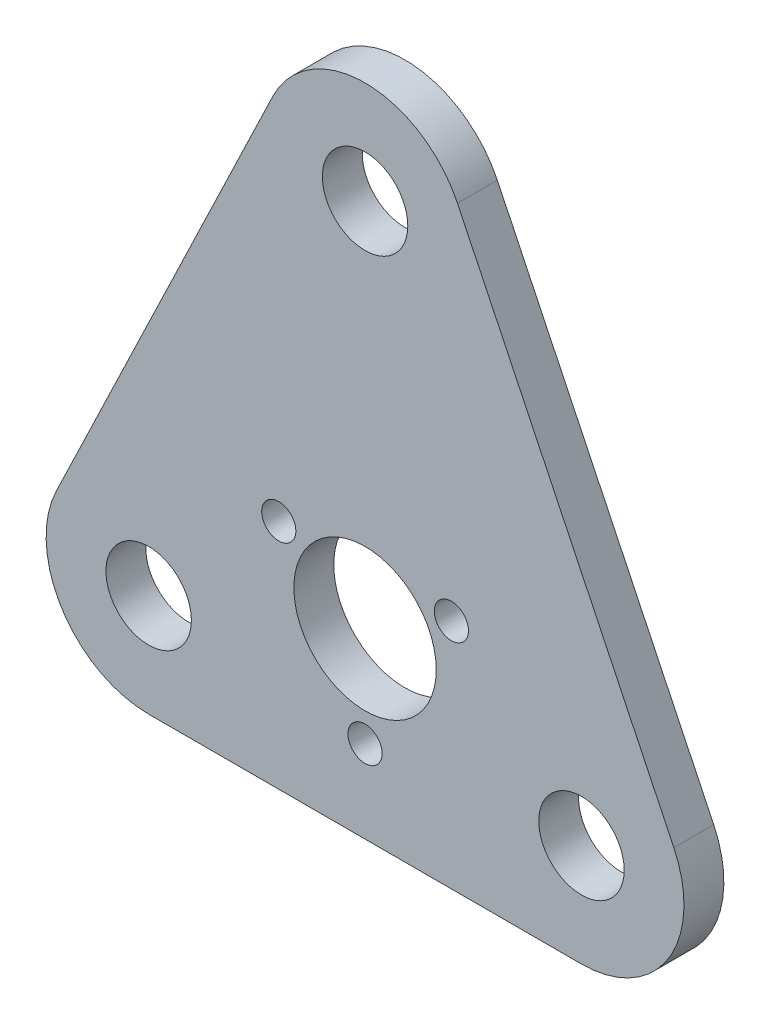
ISO-10303-21;
HEADER;
FILE_DESCRIPTION(('STEP AP214'),'2;1');
FILE_NAME('part.step','',(''),(''),'','','');
FILE_SCHEMA(('AUTOMOTIVE_DESIGN { 1 0 10303 214 1 1 1 1 }'));
ENDSEC;
DATA;
#1=APPLICATION_CONTEXT('core data for automotive mechanical design processes');
#2=APPLICATION_PROTOCOL_DEFINITION('international standard','automotive_design',2000,#1);
#3=PRODUCT_CONTEXT('',#1,'mechanical');
#4=PRODUCT('Part','Part','',(#3));
#5=PRODUCT_RELATED_PRODUCT_CATEGORY('part','',(#4));
#6=PRODUCT_DEFINITION_FORMATION('','',#4);
#7=PRODUCT_DEFINITION_CONTEXT('part definition',#1,'design');
#8=PRODUCT_DEFINITION('design','',#6,#7);
#9=PRODUCT_DEFINITION_SHAPE('','',#8);
#10=(LENGTH_UNIT() NAMED_UNIT(*) SI_UNIT(.MILLI.,.METRE.));
#11=(NAMED_UNIT(*) PLANE_ANGLE_UNIT() SI_UNIT($,.RADIAN.));
#12=(NAMED_UNIT(*) SI_UNIT($,.STERADIAN.) SOLID_ANGLE_UNIT());
#13=UNCERTAINTY_MEASURE_WITH_UNIT(LENGTH_MEASURE(1.E-05),#10,'distance_accuracy_value','');
#14=(GEOMETRIC_REPRESENTATION_CONTEXT(3) GLOBAL_UNCERTAINTY_ASSIGNED_CONTEXT((#13)) GLOBAL_UNIT_ASSIGNED_CONTEXT((#10,
#11,#12)) REPRESENTATION_CONTEXT('',''));
#15=CARTESIAN_POINT('',(0.,0.,0.));
#16=DIRECTION('',(0.,0.,1.));
#17=DIRECTION('',(1.,0.,0.));
#18=AXIS2_PLACEMENT_3D('',#15,#16,#17);
#19=CARTESIAN_POINT('',(38.,0.,3.5));
#20=DIRECTION('',(0.,0.,1.));
#21=DIRECTION('',(1.,0.,0.));
#22=AXIS2_PLACEMENT_3D('',#19,#20,#21);
#23=PLANE('',#22);
#24=CARTESIAN_POINT('',(0.,-3.5,3.5));
#25=DIRECTION('',(0.,0.,1.));
#26=DIRECTION('',(1.,0.,0.));
#27=AXIS2_PLACEMENT_3D('',#24,#25,#26);
#28=CIRCLE('',#27,3.);
#29=CARTESIAN_POINT('',(3.,-3.5,3.5));
#30=VERTEX_POINT('',#29);
#31=EDGE_CURVE('E228',#30,#30,#28,.T.);
#32=ORIENTED_EDGE('',*,*,#31,.F.);
#33=EDGE_LOOP('',(#32));
#34=FACE_BOUND('',#33,.T.);
#35=CARTESIAN_POINT('',(0.,79.,3.5));
#36=DIRECTION('',(0.,0.,1.));
#37=DIRECTION('',(1.,0.,0.));
#38=AXIS2_PLACEMENT_3D('',#35,#36,#37);
#39=CIRCLE('',#38,7.5);
#40=CARTESIAN_POINT('',(7.5,79.,3.5));
#41=VERTEX_POINT('',#40);
#42=EDGE_CURVE('E244',#41,#41,#39,.T.);
#43=ORIENTED_EDGE('',*,*,#42,.F.);
#44=EDGE_LOOP('',(#43));
#45=FACE_BOUND('',#44,.T.);
#46=CARTESIAN_POINT('',(38.,0.,3.5));
#47=DIRECTION('',(0.,0.,1.));
#48=DIRECTION('',(1.,0.,0.));
#49=AXIS2_PLACEMENT_3D('',#46,#47,#48);
#50=CIRCLE('',#49,7.5);
#51=CARTESIAN_POINT('',(45.5,0.,3.5));
#52=VERTEX_POINT('',#51);
#53=EDGE_CURVE('E260',#52,#52,#50,.T.);
#54=ORIENTED_EDGE('',*,*,#53,.F.);
#55=EDGE_LOOP('',(#54));
#56=FACE_BOUND('',#55,.T.);
#57=CARTESIAN_POINT('',(38.,0.,3.5));
#58=DIRECTION('',(0.,0.,1.));
#59=DIRECTION('',(1.,0.,0.));
#60=AXIS2_PLACEMENT_3D('',#57,#58,#59);
#61=CIRCLE('',#60,18.);
#62=CARTESIAN_POINT('',(38.,-18.,3.5));
#63=VERTEX_POINT('',#62);
#64=CARTESIAN_POINT('',(54.2210013513531,7.80250697913188,3.5));
#65=VERTEX_POINT('',#64);
#66=EDGE_CURVE('E150',#63,#65,#61,.T.);
#67=ORIENTED_EDGE('',*,*,#66,.T.);
#68=DIRECTION('',(-0.43347260995177,0.901166741741838,0.));
#69=VECTOR('',#68,1.);
#70=CARTESIAN_POINT('',(16.2210013513531,86.8025069791319,3.5));
#71=LINE('',#70,#69);
#72=CARTESIAN_POINT('',(16.2210013513531,86.8025069791319,3.5));
#73=VERTEX_POINT('',#72);
#74=EDGE_CURVE('E98',#65,#73,#71,.T.);
#75=ORIENTED_EDGE('',*,*,#74,.T.);
#76=CARTESIAN_POINT('',(0.,79.,3.5));
#77=DIRECTION('',(0.,0.,1.));
#78=DIRECTION('',(1.,0.,0.));
#79=AXIS2_PLACEMENT_3D('',#76,#77,#78);
#80=CIRCLE('',#79,18.);
#81=CARTESIAN_POINT('',(-16.2210013513531,86.8025069791319,3.5));
#82=VERTEX_POINT('',#81);
#83=EDGE_CURVE('E111',#73,#82,#80,.T.);
#84=ORIENTED_EDGE('',*,*,#83,.T.);
#85=DIRECTION('',(-0.43347260995177,-0.901166741741838,0.));
#86=VECTOR('',#85,1.);
#87=CARTESIAN_POINT('',(-16.2210013513531,86.8025069791319,3.5));
#88=LINE('',#87,#86);
#89=CARTESIAN_POINT('',(-54.2210013513531,7.80250697913186,3.5));
#90=VERTEX_POINT('',#89);
#91=EDGE_CURVE('E105',#82,#90,#88,.T.);
#92=ORIENTED_EDGE('',*,*,#91,.T.);
#93=CARTESIAN_POINT('',(-38.,0.,3.5));
#94=DIRECTION('',(0.,0.,1.));
#95=DIRECTION('',(1.,0.,0.));
#96=AXIS2_PLACEMENT_3D('',#93,#94,#95);
#97=CIRCLE('',#96,18.);
#98=CARTESIAN_POINT('',(-38.,-18.,3.5));
#99=VERTEX_POINT('',#98);
#100=EDGE_CURVE('E109',#90,#99,#97,.T.);
#101=ORIENTED_EDGE('',*,*,#100,.T.);
#102=DIRECTION('',(1.,0.,0.));
#103=VECTOR('',#102,1.);
#104=CARTESIAN_POINT('',(-38.,-18.,3.5));
#105=LINE('',#104,#103);
#106=EDGE_CURVE('E61',#99,#63,#105,.T.);
#107=ORIENTED_EDGE('',*,*,#106,.T.);
#108=EDGE_LOOP('',(#67,#75,#84,#92,#101,#107));
#109=FACE_BOUND('',#108,.T.);
#110=CARTESIAN_POINT('',(-38.,0.,3.5));
#111=DIRECTION('',(0.,0.,1.));
#112=DIRECTION('',(1.,0.,0.));
#113=AXIS2_PLACEMENT_3D('',#110,#111,#112);
#114=CIRCLE('',#113,7.5);
#115=CARTESIAN_POINT('',(-30.5,0.,3.5));
#116=VERTEX_POINT('',#115);
#117=EDGE_CURVE('E138',#116,#116,#114,.T.);
#118=ORIENTED_EDGE('',*,*,#117,.F.);
#119=EDGE_LOOP('',(#118));
#120=FACE_BOUND('',#119,.T.);
#121=CARTESIAN_POINT('',(0.,14.,3.5));
#122=DIRECTION('',(0.,0.,1.));
#123=DIRECTION('',(1.,0.,0.));
#124=AXIS2_PLACEMENT_3D('',#121,#122,#123);
#125=CIRCLE('',#124,12.5);
#126=CARTESIAN_POINT('',(12.5,14.,3.5));
#127=VERTEX_POINT('',#126);
#128=EDGE_CURVE('E252',#127,#127,#125,.T.);
#129=ORIENTED_EDGE('',*,*,#128,.F.);
#130=EDGE_LOOP('',(#129));
#131=FACE_BOUND('',#130,.T.);
#132=CARTESIAN_POINT('',(-15.1554445662277,22.7499999999999,3.5));
#133=DIRECTION('',(0.,0.,1.));
#134=DIRECTION('',(1.,0.,0.));
#135=AXIS2_PLACEMENT_3D('',#132,#133,#134);
#136=CIRCLE('',#135,3.00000000000001);
#137=CARTESIAN_POINT('',(-12.1554445662277,22.7499999999999,3.5));
#138=VERTEX_POINT('',#137);
#139=EDGE_CURVE('E236',#138,#138,#136,.T.);
#140=ORIENTED_EDGE('',*,*,#139,.F.);
#141=EDGE_LOOP('',(#140));
#142=FACE_BOUND('',#141,.T.);
#143=CARTESIAN_POINT('',(15.1554445662277,22.7499999999999,3.5));
#144=DIRECTION('',(0.,0.,1.));
#145=DIRECTION('',(1.,0.,0.));
#146=AXIS2_PLACEMENT_3D('',#143,#144,#145);
#147=CIRCLE('',#146,3.);
#148=CARTESIAN_POINT('',(18.1554445662277,22.7499999999999,3.5));
#149=VERTEX_POINT('',#148);
#150=EDGE_CURVE('E217',#149,#149,#147,.T.);
#151=ORIENTED_EDGE('',*,*,#150,.F.);
#152=EDGE_LOOP('',(#151));
#153=FACE_BOUND('',#152,.T.);
#154=ADVANCED_FACE('F43',(#34,#45,#56,#109,#120,#131,#142,#153),#23,.T.);
#155=CARTESIAN_POINT('',(38.,0.,-3.5));
#156=DIRECTION('',(0.,0.,1.));
#157=DIRECTION('',(1.,0.,0.));
#158=AXIS2_PLACEMENT_3D('',#155,#156,#157);
#159=PLANE('',#158);
#160=CARTESIAN_POINT('',(38.,0.,-3.5));
#161=DIRECTION('',(0.,0.,1.));
#162=DIRECTION('',(1.,0.,0.));
#163=AXIS2_PLACEMENT_3D('',#160,#161,#162);
#164=CIRCLE('',#163,18.);
#165=CARTESIAN_POINT('',(38.,-18.,-3.5));
#166=VERTEX_POINT('',#165);
#167=CARTESIAN_POINT('',(54.2210013513531,7.80250697913188,-3.5));
#168=VERTEX_POINT('',#167);
#169=EDGE_CURVE('E133',#166,#168,#164,.T.);
#170=ORIENTED_EDGE('',*,*,#169,.F.);
#171=DIRECTION('',(1.,0.,0.));
#172=VECTOR('',#171,1.);
#173=CARTESIAN_POINT('',(-38.,-18.,-3.5));
#174=LINE('',#173,#172);
#175=CARTESIAN_POINT('',(-38.,-18.,-3.5));
#176=VERTEX_POINT('',#175);
#177=EDGE_CURVE('E90',#176,#166,#174,.T.);
#178=ORIENTED_EDGE('',*,*,#177,.F.);
#179=CARTESIAN_POINT('',(-38.,0.,-3.5));
#180=DIRECTION('',(0.,0.,1.));
#181=DIRECTION('',(1.,0.,0.));
#182=AXIS2_PLACEMENT_3D('',#179,#180,#181);
#183=CIRCLE('',#182,18.);
#184=CARTESIAN_POINT('',(-54.2210013513531,7.80250697913186,-3.5));
#185=VERTEX_POINT('',#184);
#186=EDGE_CURVE('E84',#185,#176,#183,.T.);
#187=ORIENTED_EDGE('',*,*,#186,.F.);
#188=DIRECTION('',(-0.43347260995177,-0.901166741741838,0.));
#189=VECTOR('',#188,1.);
#190=CARTESIAN_POINT('',(-16.2210013513531,86.8025069791319,-3.5));
#191=LINE('',#190,#189);
#192=CARTESIAN_POINT('',(-16.2210013513531,86.8025069791319,-3.5));
#193=VERTEX_POINT('',#192);
#194=EDGE_CURVE('E120',#193,#185,#191,.T.);
#195=ORIENTED_EDGE('',*,*,#194,.F.);
#196=CARTESIAN_POINT('',(0.,79.,-3.5));
#197=DIRECTION('',(0.,0.,1.));
#198=DIRECTION('',(1.,0.,0.));
#199=AXIS2_PLACEMENT_3D('',#196,#197,#198);
#200=CIRCLE('',#199,18.);
#201=CARTESIAN_POINT('',(16.2210013513531,86.8025069791319,-3.5));
#202=VERTEX_POINT('',#201);
#203=EDGE_CURVE('E141',#202,#193,#200,.T.);
#204=ORIENTED_EDGE('',*,*,#203,.F.);
#205=DIRECTION('',(-0.43347260995177,0.901166741741838,0.));
#206=VECTOR('',#205,1.);
#207=CARTESIAN_POINT('',(16.2210013513531,86.8025069791319,-3.5));
#208=LINE('',#207,#206);
#209=EDGE_CURVE('E137',#168,#202,#208,.T.);
#210=ORIENTED_EDGE('',*,*,#209,.F.);
#211=EDGE_LOOP('',(#170,#178,#187,#195,#204,#210));
#212=FACE_BOUND('',#211,.T.);
#213=CARTESIAN_POINT('',(-38.,0.,-3.5));
#214=DIRECTION('',(0.,0.,1.));
#215=DIRECTION('',(1.,0.,0.));
#216=AXIS2_PLACEMENT_3D('',#213,#214,#215);
#217=CIRCLE('',#216,7.5);
#218=CARTESIAN_POINT('',(-30.5,0.,-3.5));
#219=VERTEX_POINT('',#218);
#220=EDGE_CURVE('E264',#219,#219,#217,.T.);
#221=ORIENTED_EDGE('',*,*,#220,.T.);
#222=EDGE_LOOP('',(#221));
#223=FACE_BOUND('',#222,.T.);
#224=CARTESIAN_POINT('',(38.,0.,-3.5));
#225=DIRECTION('',(0.,0.,1.));
#226=DIRECTION('',(1.,0.,0.));
#227=AXIS2_PLACEMENT_3D('',#224,#225,#226);
#228=CIRCLE('',#227,7.5);
#229=CARTESIAN_POINT('',(45.5,0.,-3.5));
#230=VERTEX_POINT('',#229);
#231=EDGE_CURVE('E256',#230,#230,#228,.T.);
#232=ORIENTED_EDGE('',*,*,#231,.T.);
#233=EDGE_LOOP('',(#232));
#234=FACE_BOUND('',#233,.T.);
#235=CARTESIAN_POINT('',(0.,14.,-3.5));
#236=DIRECTION('',(0.,0.,1.));
#237=DIRECTION('',(1.,0.,0.));
#238=AXIS2_PLACEMENT_3D('',#235,#236,#237);
#239=CIRCLE('',#238,12.5);
#240=CARTESIAN_POINT('',(12.5,14.,-3.5));
#241=VERTEX_POINT('',#240);
#242=EDGE_CURVE('E248',#241,#241,#239,.T.);
#243=ORIENTED_EDGE('',*,*,#242,.T.);
#244=EDGE_LOOP('',(#243));
#245=FACE_BOUND('',#244,.T.);
#246=CARTESIAN_POINT('',(0.,79.,-3.5));
#247=DIRECTION('',(0.,0.,1.));
#248=DIRECTION('',(1.,0.,0.));
#249=AXIS2_PLACEMENT_3D('',#246,#247,#248);
#250=CIRCLE('',#249,7.5);
#251=CARTESIAN_POINT('',(7.5,79.,-3.5));
#252=VERTEX_POINT('',#251);
#253=EDGE_CURVE('E240',#252,#252,#250,.T.);
#254=ORIENTED_EDGE('',*,*,#253,.T.);
#255=EDGE_LOOP('',(#254));
#256=FACE_BOUND('',#255,.T.);
#257=CARTESIAN_POINT('',(-15.1554445662277,22.7499999999999,-3.5));
#258=DIRECTION('',(0.,0.,1.));
#259=DIRECTION('',(1.,0.,0.));
#260=AXIS2_PLACEMENT_3D('',#257,#258,#259);
#261=CIRCLE('',#260,3.00000000000001);
#262=CARTESIAN_POINT('',(-12.1554445662277,22.7499999999999,-3.5));
#263=VERTEX_POINT('',#262);
#264=EDGE_CURVE('E232',#263,#263,#261,.T.);
#265=ORIENTED_EDGE('',*,*,#264,.T.);
#266=EDGE_LOOP('',(#265));
#267=FACE_BOUND('',#266,.T.);
#268=CARTESIAN_POINT('',(0.,-3.5,-3.5));
#269=DIRECTION('',(0.,0.,1.));
#270=DIRECTION('',(1.,0.,0.));
#271=AXIS2_PLACEMENT_3D('',#268,#269,#270);
#272=CIRCLE('',#271,3.);
#273=CARTESIAN_POINT('',(3.,-3.5,-3.5));
#274=VERTEX_POINT('',#273);
#275=EDGE_CURVE('E225',#274,#274,#272,.T.);
#276=ORIENTED_EDGE('',*,*,#275,.T.);
#277=EDGE_LOOP('',(#276));
#278=FACE_BOUND('',#277,.T.);
#279=CARTESIAN_POINT('',(15.1554445662277,22.7499999999999,-3.5));
#280=DIRECTION('',(0.,0.,1.));
#281=DIRECTION('',(1.,0.,0.));
#282=AXIS2_PLACEMENT_3D('',#279,#280,#281);
#283=CIRCLE('',#282,3.);
#284=CARTESIAN_POINT('',(18.1554445662277,22.7499999999999,-3.5));
#285=VERTEX_POINT('',#284);
#286=EDGE_CURVE('E220',#285,#285,#283,.T.);
#287=ORIENTED_EDGE('',*,*,#286,.T.);
#288=EDGE_LOOP('',(#287));
#289=FACE_BOUND('',#288,.T.);
#290=ADVANCED_FACE('F163',(#212,#223,#234,#245,#256,#267,#278,#289),#159,.F.);
#291=CARTESIAN_POINT('',(38.,0.,3.5));
#292=DIRECTION('',(0.,0.,-1.));
#293=DIRECTION('',(-1.,0.,0.));
#294=AXIS2_PLACEMENT_3D('',#291,#292,#293);
#295=CYLINDRICAL_SURFACE('',#294,18.);
#296=ORIENTED_EDGE('',*,*,#169,.T.);
#297=DIRECTION('',(0.,0.,-1.));
#298=VECTOR('',#297,1.);
#299=CARTESIAN_POINT('',(54.2210013513531,7.80250697913188,3.5));
#300=LINE('',#299,#298);
#301=EDGE_CURVE('E11',#65,#168,#300,.T.);
#302=ORIENTED_EDGE('',*,*,#301,.F.);
#303=ORIENTED_EDGE('',*,*,#66,.F.);
#304=DIRECTION('',(0.,0.,-1.));
#305=VECTOR('',#304,1.);
#306=CARTESIAN_POINT('',(38.,-18.,3.5));
#307=LINE('',#306,#305);
#308=EDGE_CURVE('E129',#63,#166,#307,.T.);
#309=ORIENTED_EDGE('',*,*,#308,.T.);
#310=EDGE_LOOP('',(#296,#302,#303,#309));
#311=FACE_BOUND('',#310,.T.);
#312=ADVANCED_FACE('F45',(#311),#295,.T.);
#313=CARTESIAN_POINT('',(16.2210013513531,86.8025069791319,3.5));
#314=DIRECTION('',(-0.901166741741838,-0.43347260995177,0.));
#315=DIRECTION('',(0.43347260995177,-0.901166741741838,0.));
#316=AXIS2_PLACEMENT_3D('',#313,#314,#315);
#317=PLANE('',#316);
#318=ORIENTED_EDGE('',*,*,#209,.T.);
#319=DIRECTION('',(0.,0.,-1.));
#320=VECTOR('',#319,1.);
#321=CARTESIAN_POINT('',(16.2210013513531,86.8025069791319,3.5));
#322=LINE('',#321,#320);
#323=EDGE_CURVE('E53',#73,#202,#322,.T.);
#324=ORIENTED_EDGE('',*,*,#323,.F.);
#325=ORIENTED_EDGE('',*,*,#74,.F.);
#326=ORIENTED_EDGE('',*,*,#301,.T.);
#327=EDGE_LOOP('',(#318,#324,#325,#326));
#328=FACE_BOUND('',#327,.T.);
#329=ADVANCED_FACE('F359',(#328),#317,.F.);
#330=CARTESIAN_POINT('',(0.,79.,3.5));
#331=DIRECTION('',(0.,0.,-1.));
#332=DIRECTION('',(-1.,0.,0.));
#333=AXIS2_PLACEMENT_3D('',#330,#331,#332);
#334=CYLINDRICAL_SURFACE('',#333,18.);
#335=ORIENTED_EDGE('',*,*,#203,.T.);
#336=DIRECTION('',(0.,0.,-1.));
#337=VECTOR('',#336,1.);
#338=CARTESIAN_POINT('',(-16.2210013513531,86.8025069791319,3.5));
#339=LINE('',#338,#337);
#340=EDGE_CURVE('E122',#82,#193,#339,.T.);
#341=ORIENTED_EDGE('',*,*,#340,.F.);
#342=ORIENTED_EDGE('',*,*,#83,.F.);
#343=ORIENTED_EDGE('',*,*,#323,.T.);
#344=EDGE_LOOP('',(#335,#341,#342,#343));
#345=FACE_BOUND('',#344,.T.);
#346=ADVANCED_FACE('F160',(#345),#334,.T.);
#347=CARTESIAN_POINT('',(-16.2210013513531,86.8025069791319,3.5));
#348=DIRECTION('',(0.901166741741838,-0.43347260995177,0.));
#349=DIRECTION('',(0.43347260995177,0.901166741741838,0.));
#350=AXIS2_PLACEMENT_3D('',#347,#348,#349);
#351=PLANE('',#350);
#352=ORIENTED_EDGE('',*,*,#194,.T.);
#353=DIRECTION('',(0.,0.,-1.));
#354=VECTOR('',#353,1.);
#355=CARTESIAN_POINT('',(-54.2210013513531,7.80250697913186,3.5));
#356=LINE('',#355,#354);
#357=EDGE_CURVE('E117',#90,#185,#356,.T.);
#358=ORIENTED_EDGE('',*,*,#357,.F.);
#359=ORIENTED_EDGE('',*,*,#91,.F.);
#360=ORIENTED_EDGE('',*,*,#340,.T.);
#361=EDGE_LOOP('',(#352,#358,#359,#360));
#362=FACE_BOUND('',#361,.T.);
#363=ADVANCED_FACE('F118',(#362),#351,.F.);
#364=CARTESIAN_POINT('',(-38.,0.,3.5));
#365=DIRECTION('',(0.,0.,-1.));
#366=DIRECTION('',(-1.,0.,0.));
#367=AXIS2_PLACEMENT_3D('',#364,#365,#366);
#368=CYLINDRICAL_SURFACE('',#367,18.);
#369=ORIENTED_EDGE('',*,*,#186,.T.);
#370=DIRECTION('',(0.,0.,-1.));
#371=VECTOR('',#370,1.);
#372=CARTESIAN_POINT('',(-38.,-18.,3.5));
#373=LINE('',#372,#371);
#374=EDGE_CURVE('E123',#99,#176,#373,.T.);
#375=ORIENTED_EDGE('',*,*,#374,.F.);
#376=ORIENTED_EDGE('',*,*,#100,.F.);
#377=ORIENTED_EDGE('',*,*,#357,.T.);
#378=EDGE_LOOP('',(#369,#375,#376,#377));
#379=FACE_BOUND('',#378,.T.);
#380=ADVANCED_FACE('F125',(#379),#368,.T.);
#381=CARTESIAN_POINT('',(-38.,-18.,3.5));
#382=DIRECTION('',(0.,1.,0.));
#383=DIRECTION('',(-1.,0.,0.));
#384=AXIS2_PLACEMENT_3D('',#381,#382,#383);
#385=PLANE('',#384);
#386=ORIENTED_EDGE('',*,*,#177,.T.);
#387=ORIENTED_EDGE('',*,*,#308,.F.);
#388=ORIENTED_EDGE('',*,*,#106,.F.);
#389=ORIENTED_EDGE('',*,*,#374,.T.);
#390=EDGE_LOOP('',(#386,#387,#388,#389));
#391=FACE_BOUND('',#390,.T.);
#392=ADVANCED_FACE('F168',(#391),#385,.F.);
#393=CARTESIAN_POINT('',(-38.,0.,3.5));
#394=DIRECTION('',(0.,0.,-1.));
#395=DIRECTION('',(-1.,0.,0.));
#396=AXIS2_PLACEMENT_3D('',#393,#394,#395);
#397=CYLINDRICAL_SURFACE('',#396,7.5);
#398=ORIENTED_EDGE('',*,*,#117,.T.);
#399=EDGE_LOOP('',(#398));
#400=FACE_BOUND('',#399,.T.);
#401=ORIENTED_EDGE('',*,*,#220,.F.);
#402=EDGE_LOOP('',(#401));
#403=FACE_BOUND('',#402,.T.);
#404=ADVANCED_FACE('F170',(#400,#403),#397,.F.);
#405=CARTESIAN_POINT('',(38.,0.,3.5));
#406=DIRECTION('',(0.,0.,-1.));
#407=DIRECTION('',(-1.,0.,0.));
#408=AXIS2_PLACEMENT_3D('',#405,#406,#407);
#409=CYLINDRICAL_SURFACE('',#408,7.5);
#410=ORIENTED_EDGE('',*,*,#53,.T.);
#411=EDGE_LOOP('',(#410));
#412=FACE_BOUND('',#411,.T.);
#413=ORIENTED_EDGE('',*,*,#231,.F.);
#414=EDGE_LOOP('',(#413));
#415=FACE_BOUND('',#414,.T.);
#416=ADVANCED_FACE('F176',(#412,#415),#409,.F.);
#417=CARTESIAN_POINT('',(0.,14.,3.5));
#418=DIRECTION('',(0.,0.,-1.));
#419=DIRECTION('',(-1.,0.,0.));
#420=AXIS2_PLACEMENT_3D('',#417,#418,#419);
#421=CYLINDRICAL_SURFACE('',#420,12.5);
#422=ORIENTED_EDGE('',*,*,#128,.T.);
#423=EDGE_LOOP('',(#422));
#424=FACE_BOUND('',#423,.T.);
#425=ORIENTED_EDGE('',*,*,#242,.F.);
#426=EDGE_LOOP('',(#425));
#427=FACE_BOUND('',#426,.T.);
#428=ADVANCED_FACE('F192',(#424,#427),#421,.F.);
#429=CARTESIAN_POINT('',(0.,79.,3.5));
#430=DIRECTION('',(0.,0.,-1.));
#431=DIRECTION('',(-1.,0.,0.));
#432=AXIS2_PLACEMENT_3D('',#429,#430,#431);
#433=CYLINDRICAL_SURFACE('',#432,7.5);
#434=ORIENTED_EDGE('',*,*,#42,.T.);
#435=EDGE_LOOP('',(#434));
#436=FACE_BOUND('',#435,.T.);
#437=ORIENTED_EDGE('',*,*,#253,.F.);
#438=EDGE_LOOP('',(#437));
#439=FACE_BOUND('',#438,.T.);
#440=ADVANCED_FACE('F196',(#436,#439),#433,.F.);
#441=CARTESIAN_POINT('',(-15.1554445662277,22.7499999999999,3.5));
#442=DIRECTION('',(0.,0.,-1.));
#443=DIRECTION('',(-1.,0.,0.));
#444=AXIS2_PLACEMENT_3D('',#441,#442,#443);
#445=CYLINDRICAL_SURFACE('',#444,3.00000000000001);
#446=ORIENTED_EDGE('',*,*,#139,.T.);
#447=EDGE_LOOP('',(#446));
#448=FACE_BOUND('',#447,.T.);
#449=ORIENTED_EDGE('',*,*,#264,.F.);
#450=EDGE_LOOP('',(#449));
#451=FACE_BOUND('',#450,.T.);
#452=ADVANCED_FACE('F200',(#448,#451),#445,.F.);
#453=CARTESIAN_POINT('',(0.,-3.5,3.5));
#454=DIRECTION('',(0.,0.,-1.));
#455=DIRECTION('',(-1.,0.,0.));
#456=AXIS2_PLACEMENT_3D('',#453,#454,#455);
#457=CYLINDRICAL_SURFACE('',#456,3.);
#458=ORIENTED_EDGE('',*,*,#31,.T.);
#459=EDGE_LOOP('',(#458));
#460=FACE_BOUND('',#459,.T.);
#461=ORIENTED_EDGE('',*,*,#275,.F.);
#462=EDGE_LOOP('',(#461));
#463=FACE_BOUND('',#462,.T.);
#464=ADVANCED_FACE('F204',(#460,#463),#457,.F.);
#465=CARTESIAN_POINT('',(15.1554445662277,22.7499999999999,3.5));
#466=DIRECTION('',(0.,0.,-1.));
#467=DIRECTION('',(-1.,0.,0.));
#468=AXIS2_PLACEMENT_3D('',#465,#466,#467);
#469=CYLINDRICAL_SURFACE('',#468,3.);
#470=ORIENTED_EDGE('',*,*,#150,.T.);
#471=EDGE_LOOP('',(#470));
#472=FACE_BOUND('',#471,.T.);
#473=ORIENTED_EDGE('',*,*,#286,.F.);
#474=EDGE_LOOP('',(#473));
#475=FACE_BOUND('',#474,.T.);
#476=ADVANCED_FACE('F208',(#472,#475),#469,.F.);
#477=CLOSED_SHELL('',(#154,#290,#312,#329,#346,#363,#380,#392,#404,#416,#428,#440,#452,#464,#476));
#478=MANIFOLD_SOLID_BREP('B2',#477);
#479=ADVANCED_BREP_SHAPE_REPRESENTATION('',(#18,#478),#14);
#480=SHAPE_DEFINITION_REPRESENTATION(#9,#479);
ENDSEC;
END-ISO-10303-21;
